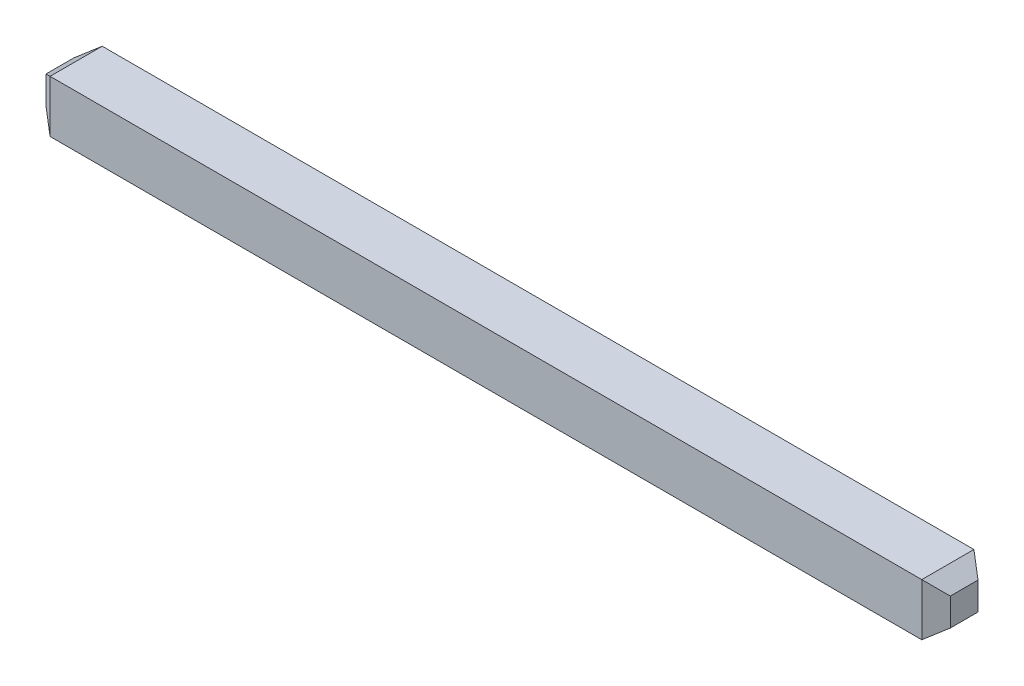
ISO-10303-21;
HEADER;
FILE_DESCRIPTION(('STEP AP214'),'2;1');
FILE_NAME('part.step','',(''),(''),'','','');
FILE_SCHEMA(('AUTOMOTIVE_DESIGN { 1 0 10303 214 1 1 1 1 }'));
ENDSEC;
DATA;
#1=APPLICATION_CONTEXT('core data for automotive mechanical design processes');
#2=APPLICATION_PROTOCOL_DEFINITION('international standard','automotive_design',2000,#1);
#3=PRODUCT_CONTEXT('',#1,'mechanical');
#4=PRODUCT('Part','Part','',(#3));
#5=PRODUCT_RELATED_PRODUCT_CATEGORY('part','',(#4));
#6=PRODUCT_DEFINITION_FORMATION('','',#4);
#7=PRODUCT_DEFINITION_CONTEXT('part definition',#1,'design');
#8=PRODUCT_DEFINITION('design','',#6,#7);
#9=PRODUCT_DEFINITION_SHAPE('','',#8);
#10=(LENGTH_UNIT() NAMED_UNIT(*) SI_UNIT(.MILLI.,.METRE.));
#11=(NAMED_UNIT(*) PLANE_ANGLE_UNIT() SI_UNIT($,.RADIAN.));
#12=(NAMED_UNIT(*) SI_UNIT($,.STERADIAN.) SOLID_ANGLE_UNIT());
#13=UNCERTAINTY_MEASURE_WITH_UNIT(LENGTH_MEASURE(1.E-05),#10,'distance_accuracy_value','');
#14=(GEOMETRIC_REPRESENTATION_CONTEXT(3) GLOBAL_UNCERTAINTY_ASSIGNED_CONTEXT((#13)) GLOBAL_UNIT_ASSIGNED_CONTEXT((#10,
#11,#12)) REPRESENTATION_CONTEXT('',''));
#15=CARTESIAN_POINT('',(0.,0.,0.));
#16=DIRECTION('',(0.,0.,1.));
#17=DIRECTION('',(1.,0.,0.));
#18=AXIS2_PLACEMENT_3D('',#15,#16,#17);
#19=CARTESIAN_POINT('',(-2.4,1.23,-9.135));
#20=DIRECTION('',(0.6,0.,0.8));
#21=DIRECTION('',(0.8,0.,-0.6));
#22=AXIS2_PLACEMENT_3D('',#19,#20,#21);
#23=PLANE('',#22);
#24=DIRECTION('',(0.,1.,0.));
#25=VECTOR('',#24,1.);
#26=CARTESIAN_POINT('',(-2.3,1.23,-9.21));
#27=LINE('',#26,#25);
#28=CARTESIAN_POINT('',(-2.3,1.55,-9.21));
#29=VERTEX_POINT('',#28);
#30=CARTESIAN_POINT('',(-2.30000000000001,0.909999999999898,-9.21));
#31=VERTEX_POINT('',#30);
#32=EDGE_CURVE('E101',#29,#31,#27,.F.);
#33=ORIENTED_EDGE('',*,*,#32,.T.);
#34=DIRECTION('',(-0.685994340569491,0.51449575542834,0.514495755427438));
#35=VECTOR('',#34,1.);
#36=CARTESIAN_POINT('',(-2.30000000000009,0.909999999999786,-9.21));
#37=LINE('',#36,#35);
#38=CARTESIAN_POINT('',(-2.49999999999999,1.06000000000001,-9.06));
#39=VERTEX_POINT('',#38);
#40=EDGE_CURVE('E85',#31,#39,#37,.T.);
#41=ORIENTED_EDGE('',*,*,#40,.T.);
#42=DIRECTION('',(0.,1.,0.));
#43=VECTOR('',#42,1.);
#44=CARTESIAN_POINT('',(-2.5,1.23,-9.06));
#45=LINE('',#44,#43);
#46=CARTESIAN_POINT('',(-2.5,1.4,-9.06));
#47=VERTEX_POINT('',#46);
#48=EDGE_CURVE('E79',#39,#47,#45,.T.);
#49=ORIENTED_EDGE('',*,*,#48,.T.);
#50=DIRECTION('',(-0.685994340570034,-0.514495755427526,0.514495755427528));
#51=VECTOR('',#50,1.);
#52=CARTESIAN_POINT('',(-2.3,1.55,-9.21));
#53=LINE('',#52,#51);
#54=EDGE_CURVE('E20',#29,#47,#53,.T.);
#55=ORIENTED_EDGE('',*,*,#54,.F.);
#56=EDGE_LOOP('',(#33,#41,#49,#55));
#57=FACE_BOUND('',#56,.T.);
#58=ADVANCED_FACE('F17',(#57),#23,.F.);
#59=CARTESIAN_POINT('',(8.5,1.23,-9.135));
#60=DIRECTION('',(-0.6,0.,0.8));
#61=DIRECTION('',(0.8,0.,0.6));
#62=AXIS2_PLACEMENT_3D('',#59,#60,#61);
#63=PLANE('',#62);
#64=DIRECTION('',(0.,1.,0.));
#65=VECTOR('',#64,1.);
#66=CARTESIAN_POINT('',(8.6,1.23,-9.06));
#67=LINE('',#66,#65);
#68=CARTESIAN_POINT('',(8.59999999999998,1.06000000000003,-9.06));
#69=VERTEX_POINT('',#68);
#70=CARTESIAN_POINT('',(8.6,1.4,-9.06));
#71=VERTEX_POINT('',#70);
#72=EDGE_CURVE('E113',#69,#71,#67,.T.);
#73=ORIENTED_EDGE('',*,*,#72,.F.);
#74=DIRECTION('',(-0.685994340569492,-0.51449575542834,-0.514495755427437));
#75=VECTOR('',#74,1.);
#76=CARTESIAN_POINT('',(8.59999999999996,1.06000000000005,-9.06));
#77=LINE('',#76,#75);
#78=CARTESIAN_POINT('',(8.40000000000002,0.909999999999884,-9.21));
#79=VERTEX_POINT('',#78);
#80=EDGE_CURVE('E108',#69,#79,#77,.T.);
#81=ORIENTED_EDGE('',*,*,#80,.T.);
#82=DIRECTION('',(0.,1.,0.));
#83=VECTOR('',#82,1.);
#84=CARTESIAN_POINT('',(8.4,1.23,-9.21));
#85=LINE('',#84,#83);
#86=CARTESIAN_POINT('',(8.4,1.55,-9.21));
#87=VERTEX_POINT('',#86);
#88=EDGE_CURVE('E99',#79,#87,#85,.T.);
#89=ORIENTED_EDGE('',*,*,#88,.T.);
#90=DIRECTION('',(-0.685994340570033,0.514495755427525,-0.514495755427531));
#91=VECTOR('',#90,1.);
#92=CARTESIAN_POINT('',(8.6,1.4,-9.06));
#93=LINE('',#92,#91);
#94=EDGE_CURVE('E116',#71,#87,#93,.T.);
#95=ORIENTED_EDGE('',*,*,#94,.F.);
#96=EDGE_LOOP('',(#73,#81,#89,#95));
#97=FACE_BOUND('',#96,.T.);
#98=ADVANCED_FACE('F214',(#97),#63,.F.);
#99=CARTESIAN_POINT('',(-2.4,1.475,-8.89));
#100=DIRECTION('',(-0.6,0.8,0.));
#101=DIRECTION('',(-0.8,-0.6,0.));
#102=AXIS2_PLACEMENT_3D('',#99,#100,#101);
#103=PLANE('',#102);
#104=DIRECTION('',(-0.685994340570035,-0.514495755427529,-0.514495755427525));
#105=VECTOR('',#104,1.);
#106=CARTESIAN_POINT('',(-2.3,1.55,-8.57));
#107=LINE('',#106,#105);
#108=CARTESIAN_POINT('',(-2.3,1.55,-8.57));
#109=VERTEX_POINT('',#108);
#110=CARTESIAN_POINT('',(-2.5,1.4,-8.72));
#111=VERTEX_POINT('',#110);
#112=EDGE_CURVE('E128',#109,#111,#107,.T.);
#113=ORIENTED_EDGE('',*,*,#112,.F.);
#114=DIRECTION('',(0.,0.,1.));
#115=VECTOR('',#114,1.);
#116=CARTESIAN_POINT('',(-2.3,1.55,-8.89));
#117=LINE('',#116,#115);
#118=EDGE_CURVE('E93',#29,#109,#117,.T.);
#119=ORIENTED_EDGE('',*,*,#118,.F.);
#120=ORIENTED_EDGE('',*,*,#54,.T.);
#121=DIRECTION('',(0.,0.,-1.));
#122=VECTOR('',#121,1.);
#123=CARTESIAN_POINT('',(-2.5,1.4,-8.89));
#124=LINE('',#123,#122);
#125=EDGE_CURVE('E87',#47,#111,#124,.F.);
#126=ORIENTED_EDGE('',*,*,#125,.T.);
#127=EDGE_LOOP('',(#113,#119,#120,#126));
#128=FACE_BOUND('',#127,.T.);
#129=ADVANCED_FACE('F90',(#128),#103,.T.);
#130=CARTESIAN_POINT('',(-2.5,1.23,-8.89));
#131=DIRECTION('',(1.,0.,0.));
#132=DIRECTION('',(0.,0.,-1.));
#133=AXIS2_PLACEMENT_3D('',#130,#131,#132);
#134=PLANE('',#133);
#135=DIRECTION('',(0.,1.,0.));
#136=VECTOR('',#135,1.);
#137=CARTESIAN_POINT('',(-2.5,1.23,-8.72));
#138=LINE('',#137,#136);
#139=CARTESIAN_POINT('',(-2.49999999999999,1.06000000000001,-8.72));
#140=VERTEX_POINT('',#139);
#141=EDGE_CURVE('E97',#111,#140,#138,.F.);
#142=ORIENTED_EDGE('',*,*,#141,.F.);
#143=ORIENTED_EDGE('',*,*,#125,.F.);
#144=ORIENTED_EDGE('',*,*,#48,.F.);
#145=DIRECTION('',(0.,0.,1.));
#146=VECTOR('',#145,1.);
#147=CARTESIAN_POINT('',(-2.49999999999996,1.06000000000005,-8.89));
#148=LINE('',#147,#146);
#149=EDGE_CURVE('E105',#39,#140,#148,.T.);
#150=ORIENTED_EDGE('',*,*,#149,.T.);
#151=EDGE_LOOP('',(#142,#143,#144,#150));
#152=FACE_BOUND('',#151,.T.);
#153=ADVANCED_FACE('F95',(#152),#134,.F.);
#154=CARTESIAN_POINT('',(3.05,1.23,-9.21));
#155=DIRECTION('',(0.,0.,1.));
#156=DIRECTION('',(1.,0.,0.));
#157=AXIS2_PLACEMENT_3D('',#154,#155,#156);
#158=PLANE('',#157);
#159=ORIENTED_EDGE('',*,*,#32,.F.);
#160=DIRECTION('',(1.,0.,0.));
#161=VECTOR('',#160,1.);
#162=CARTESIAN_POINT('',(3.05,1.55,-9.21));
#163=LINE('',#162,#161);
#164=EDGE_CURVE('E122',#87,#29,#163,.F.);
#165=ORIENTED_EDGE('',*,*,#164,.F.);
#166=ORIENTED_EDGE('',*,*,#88,.F.);
#167=DIRECTION('',(1.,0.,0.));
#168=VECTOR('',#167,1.);
#169=CARTESIAN_POINT('',(3.05,0.91,-9.21));
#170=LINE('',#169,#168);
#171=EDGE_CURVE('E136',#79,#31,#170,.F.);
#172=ORIENTED_EDGE('',*,*,#171,.T.);
#173=EDGE_LOOP('',(#159,#165,#166,#172));
#174=FACE_BOUND('',#173,.T.);
#175=ADVANCED_FACE('F182',(#174),#158,.F.);
#176=CARTESIAN_POINT('',(-2.4,0.9849999999999,-8.89));
#177=DIRECTION('',(0.600000000000912,0.799999999999316,0.));
#178=DIRECTION('',(-0.799999999999316,0.600000000000912,0.));
#179=AXIS2_PLACEMENT_3D('',#176,#177,#178);
#180=PLANE('',#179);
#181=DIRECTION('',(0.,0.,1.));
#182=VECTOR('',#181,1.);
#183=CARTESIAN_POINT('',(-2.3,0.91,-8.89));
#184=LINE('',#183,#182);
#185=CARTESIAN_POINT('',(-2.30000000000004,0.909999999999856,-8.57));
#186=VERTEX_POINT('',#185);
#187=EDGE_CURVE('E139',#31,#186,#184,.T.);
#188=ORIENTED_EDGE('',*,*,#187,.T.);
#189=DIRECTION('',(0.685994340569914,-0.514495755427781,0.514495755427434));
#190=VECTOR('',#189,1.);
#191=CARTESIAN_POINT('',(-2.5,1.06,-8.72));
#192=LINE('',#191,#190);
#193=EDGE_CURVE('E131',#140,#186,#192,.T.);
#194=ORIENTED_EDGE('',*,*,#193,.F.);
#195=ORIENTED_EDGE('',*,*,#149,.F.);
#196=ORIENTED_EDGE('',*,*,#40,.F.);
#197=EDGE_LOOP('',(#188,#194,#195,#196));
#198=FACE_BOUND('',#197,.T.);
#199=ADVANCED_FACE('F179',(#198),#180,.F.);
#200=CARTESIAN_POINT('',(8.5,0.9849999999999,-8.89));
#201=DIRECTION('',(-0.600000000000912,0.799999999999316,0.));
#202=DIRECTION('',(-0.799999999999316,-0.600000000000912,0.));
#203=AXIS2_PLACEMENT_3D('',#200,#201,#202);
#204=PLANE('',#203);
#205=DIRECTION('',(0.,0.,-1.));
#206=VECTOR('',#205,1.);
#207=CARTESIAN_POINT('',(8.6,1.06,-8.89));
#208=LINE('',#207,#206);
#209=CARTESIAN_POINT('',(8.59999999999998,1.06000000000003,-8.72));
#210=VERTEX_POINT('',#209);
#211=EDGE_CURVE('E110',#210,#69,#208,.T.);
#212=ORIENTED_EDGE('',*,*,#211,.F.);
#213=DIRECTION('',(0.685994340569913,0.514495755427781,-0.514495755427435));
#214=VECTOR('',#213,1.);
#215=CARTESIAN_POINT('',(8.4,0.9099999999999,-8.57));
#216=LINE('',#215,#214);
#217=CARTESIAN_POINT('',(8.40000000000004,0.909999999999868,-8.57));
#218=VERTEX_POINT('',#217);
#219=EDGE_CURVE('E35',#218,#210,#216,.T.);
#220=ORIENTED_EDGE('',*,*,#219,.F.);
#221=DIRECTION('',(0.,0.,1.));
#222=VECTOR('',#221,1.);
#223=CARTESIAN_POINT('',(8.4,0.91,-8.89));
#224=LINE('',#223,#222);
#225=EDGE_CURVE('E134',#218,#79,#224,.F.);
#226=ORIENTED_EDGE('',*,*,#225,.T.);
#227=ORIENTED_EDGE('',*,*,#80,.F.);
#228=EDGE_LOOP('',(#212,#220,#226,#227));
#229=FACE_BOUND('',#228,.T.);
#230=ADVANCED_FACE('F181',(#229),#204,.F.);
#231=CARTESIAN_POINT('',(8.6,1.23,-8.89));
#232=DIRECTION('',(1.,0.,0.));
#233=DIRECTION('',(0.,0.,-1.));
#234=AXIS2_PLACEMENT_3D('',#231,#232,#233);
#235=PLANE('',#234);
#236=ORIENTED_EDGE('',*,*,#72,.T.);
#237=DIRECTION('',(0.,0.,1.));
#238=VECTOR('',#237,1.);
#239=CARTESIAN_POINT('',(8.6,1.4,-8.89));
#240=LINE('',#239,#238);
#241=CARTESIAN_POINT('',(8.6,1.4,-8.72));
#242=VERTEX_POINT('',#241);
#243=EDGE_CURVE('E119',#242,#71,#240,.F.);
#244=ORIENTED_EDGE('',*,*,#243,.F.);
#245=DIRECTION('',(0.,1.,0.));
#246=VECTOR('',#245,1.);
#247=CARTESIAN_POINT('',(8.6,1.23,-8.72));
#248=LINE('',#247,#246);
#249=EDGE_CURVE('E142',#210,#242,#248,.T.);
#250=ORIENTED_EDGE('',*,*,#249,.F.);
#251=ORIENTED_EDGE('',*,*,#211,.T.);
#252=EDGE_LOOP('',(#236,#244,#250,#251));
#253=FACE_BOUND('',#252,.T.);
#254=ADVANCED_FACE('F189',(#253),#235,.T.);
#255=CARTESIAN_POINT('',(8.5,1.475,-8.89));
#256=DIRECTION('',(0.6,0.8,0.));
#257=DIRECTION('',(-0.8,0.6,0.));
#258=AXIS2_PLACEMENT_3D('',#255,#256,#257);
#259=PLANE('',#258);
#260=DIRECTION('',(-0.685994340570034,0.514495755427529,0.514495755427526));
#261=VECTOR('',#260,1.);
#262=CARTESIAN_POINT('',(8.6,1.4,-8.72));
#263=LINE('',#262,#261);
#264=CARTESIAN_POINT('',(8.4,1.55,-8.57));
#265=VERTEX_POINT('',#264);
#266=EDGE_CURVE('E145',#242,#265,#263,.T.);
#267=ORIENTED_EDGE('',*,*,#266,.F.);
#268=ORIENTED_EDGE('',*,*,#243,.T.);
#269=ORIENTED_EDGE('',*,*,#94,.T.);
#270=DIRECTION('',(0.,0.,1.));
#271=VECTOR('',#270,1.);
#272=CARTESIAN_POINT('',(8.4,1.55,-8.89));
#273=LINE('',#272,#271);
#274=EDGE_CURVE('E125',#265,#87,#273,.F.);
#275=ORIENTED_EDGE('',*,*,#274,.F.);
#276=EDGE_LOOP('',(#267,#268,#269,#275));
#277=FACE_BOUND('',#276,.T.);
#278=ADVANCED_FACE('F170',(#277),#259,.T.);
#279=CARTESIAN_POINT('',(3.05,1.55,-8.89));
#280=DIRECTION('',(0.,1.,0.));
#281=DIRECTION('',(0.,0.,1.));
#282=AXIS2_PLACEMENT_3D('',#279,#280,#281);
#283=PLANE('',#282);
#284=DIRECTION('',(1.,0.,0.));
#285=VECTOR('',#284,1.);
#286=CARTESIAN_POINT('',(3.05,1.55,-8.57));
#287=LINE('',#286,#285);
#288=EDGE_CURVE('E148',#265,#109,#287,.F.);
#289=ORIENTED_EDGE('',*,*,#288,.F.);
#290=ORIENTED_EDGE('',*,*,#274,.T.);
#291=ORIENTED_EDGE('',*,*,#164,.T.);
#292=ORIENTED_EDGE('',*,*,#118,.T.);
#293=EDGE_LOOP('',(#289,#290,#291,#292));
#294=FACE_BOUND('',#293,.T.);
#295=ADVANCED_FACE('F173',(#294),#283,.T.);
#296=CARTESIAN_POINT('',(-2.4,1.23,-8.645));
#297=DIRECTION('',(-0.6,0.,0.8));
#298=DIRECTION('',(0.8,0.,0.6));
#299=AXIS2_PLACEMENT_3D('',#296,#297,#298);
#300=PLANE('',#299);
#301=ORIENTED_EDGE('',*,*,#193,.T.);
#302=DIRECTION('',(0.,1.,0.));
#303=VECTOR('',#302,1.);
#304=CARTESIAN_POINT('',(-2.3,1.23,-8.57));
#305=LINE('',#304,#303);
#306=EDGE_CURVE('E151',#109,#186,#305,.F.);
#307=ORIENTED_EDGE('',*,*,#306,.F.);
#308=ORIENTED_EDGE('',*,*,#112,.T.);
#309=ORIENTED_EDGE('',*,*,#141,.T.);
#310=EDGE_LOOP('',(#301,#307,#308,#309));
#311=FACE_BOUND('',#310,.T.);
#312=ADVANCED_FACE('F176',(#311),#300,.T.);
#313=CARTESIAN_POINT('',(3.05,0.91,-8.89));
#314=DIRECTION('',(0.,1.,0.));
#315=DIRECTION('',(0.,0.,1.));
#316=AXIS2_PLACEMENT_3D('',#313,#314,#315);
#317=PLANE('',#316);
#318=ORIENTED_EDGE('',*,*,#187,.F.);
#319=ORIENTED_EDGE('',*,*,#171,.F.);
#320=ORIENTED_EDGE('',*,*,#225,.F.);
#321=DIRECTION('',(1.,0.,0.));
#322=VECTOR('',#321,1.);
#323=CARTESIAN_POINT('',(3.05,0.9099999999999,-8.57));
#324=LINE('',#323,#322);
#325=EDGE_CURVE('E26',#186,#218,#324,.T.);
#326=ORIENTED_EDGE('',*,*,#325,.F.);
#327=EDGE_LOOP('',(#318,#319,#320,#326));
#328=FACE_BOUND('',#327,.T.);
#329=ADVANCED_FACE('F162',(#328),#317,.F.);
#330=CARTESIAN_POINT('',(8.5,1.23,-8.645));
#331=DIRECTION('',(0.6,0.,0.8));
#332=DIRECTION('',(0.8,0.,-0.6));
#333=AXIS2_PLACEMENT_3D('',#330,#331,#332);
#334=PLANE('',#333);
#335=ORIENTED_EDGE('',*,*,#266,.T.);
#336=DIRECTION('',(0.,1.,0.));
#337=VECTOR('',#336,1.);
#338=CARTESIAN_POINT('',(8.4,1.23,-8.57));
#339=LINE('',#338,#337);
#340=EDGE_CURVE('E11',#218,#265,#339,.T.);
#341=ORIENTED_EDGE('',*,*,#340,.F.);
#342=ORIENTED_EDGE('',*,*,#219,.T.);
#343=ORIENTED_EDGE('',*,*,#249,.T.);
#344=EDGE_LOOP('',(#335,#341,#342,#343));
#345=FACE_BOUND('',#344,.T.);
#346=ADVANCED_FACE('F166',(#345),#334,.T.);
#347=CARTESIAN_POINT('',(3.05,1.23,-8.57));
#348=DIRECTION('',(0.,0.,1.));
#349=DIRECTION('',(1.,0.,0.));
#350=AXIS2_PLACEMENT_3D('',#347,#348,#349);
#351=PLANE('',#350);
#352=ORIENTED_EDGE('',*,*,#325,.T.);
#353=ORIENTED_EDGE('',*,*,#340,.T.);
#354=ORIENTED_EDGE('',*,*,#288,.T.);
#355=ORIENTED_EDGE('',*,*,#306,.T.);
#356=EDGE_LOOP('',(#352,#353,#354,#355));
#357=FACE_BOUND('',#356,.T.);
#358=ADVANCED_FACE('F157',(#357),#351,.T.);
#359=CLOSED_SHELL('',(#58,#98,#129,#153,#175,#199,#230,#254,#278,#295,#312,#329,#346,#358));
#360=MANIFOLD_SOLID_BREP('B1',#359);
#361=ADVANCED_BREP_SHAPE_REPRESENTATION('',(#18,#360),#14);
#362=SHAPE_DEFINITION_REPRESENTATION(#9,#361);
ENDSEC;
END-ISO-10303-21;
